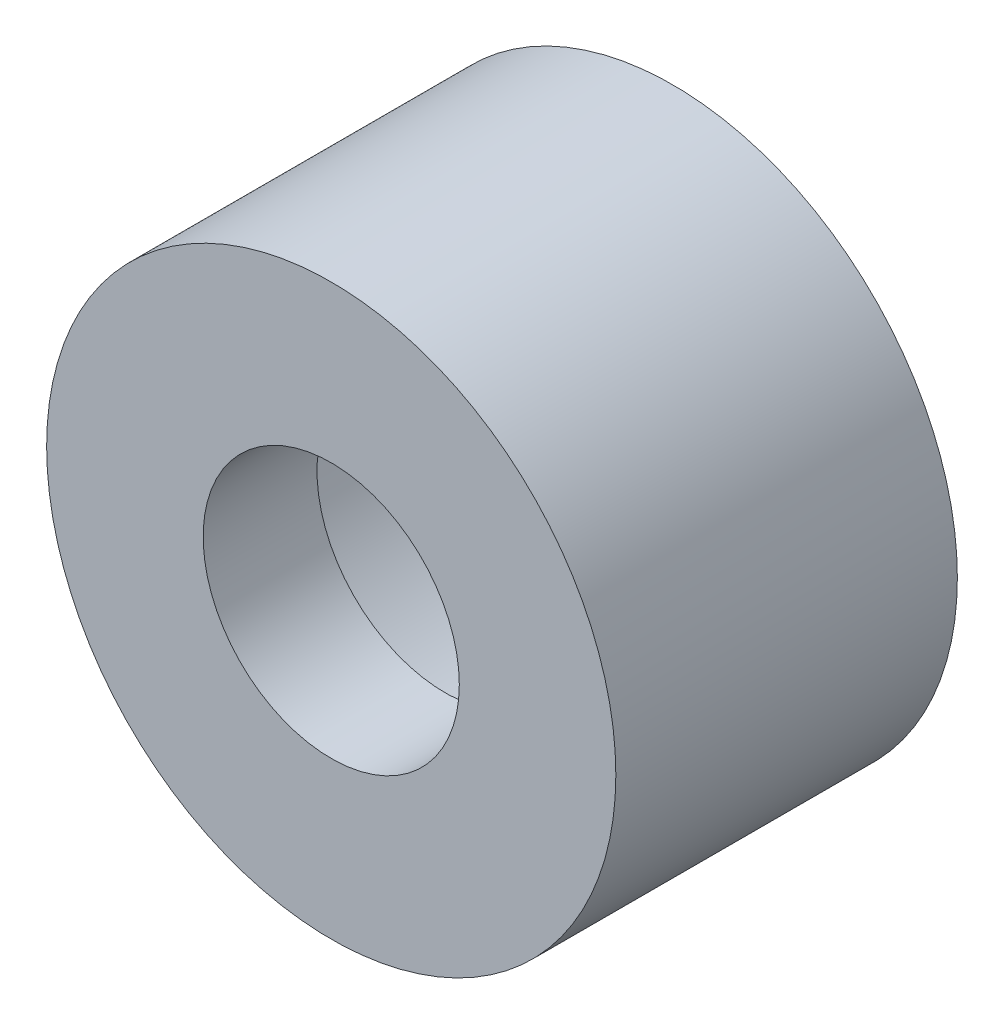
ISO-10303-21;
HEADER;
FILE_DESCRIPTION(('STEP AP214'),'2;1');
FILE_NAME('part.step','',(''),(''),'','','');
FILE_SCHEMA(('AUTOMOTIVE_DESIGN { 1 0 10303 214 1 1 1 1 }'));
ENDSEC;
DATA;
#1=APPLICATION_CONTEXT('core data for automotive mechanical design processes');
#2=APPLICATION_PROTOCOL_DEFINITION('international standard','automotive_design',2000,#1);
#3=PRODUCT_CONTEXT('',#1,'mechanical');
#4=PRODUCT('Part','Part','',(#3));
#5=PRODUCT_RELATED_PRODUCT_CATEGORY('part','',(#4));
#6=PRODUCT_DEFINITION_FORMATION('','',#4);
#7=PRODUCT_DEFINITION_CONTEXT('part definition',#1,'design');
#8=PRODUCT_DEFINITION('design','',#6,#7);
#9=PRODUCT_DEFINITION_SHAPE('','',#8);
#10=(LENGTH_UNIT() NAMED_UNIT(*) SI_UNIT(.MILLI.,.METRE.));
#11=(NAMED_UNIT(*) PLANE_ANGLE_UNIT() SI_UNIT($,.RADIAN.));
#12=(NAMED_UNIT(*) SI_UNIT($,.STERADIAN.) SOLID_ANGLE_UNIT());
#13=UNCERTAINTY_MEASURE_WITH_UNIT(LENGTH_MEASURE(1.E-05),#10,'distance_accuracy_value','');
#14=(GEOMETRIC_REPRESENTATION_CONTEXT(3) GLOBAL_UNCERTAINTY_ASSIGNED_CONTEXT((#13)) GLOBAL_UNIT_ASSIGNED_CONTEXT((#10,
#11,#12)) REPRESENTATION_CONTEXT('',''));
#15=CARTESIAN_POINT('',(0.,0.,0.));
#16=DIRECTION('',(0.,0.,1.));
#17=DIRECTION('',(1.,0.,0.));
#18=AXIS2_PLACEMENT_3D('',#15,#16,#17);
#19=CARTESIAN_POINT('',(0.,0.,0.));
#20=DIRECTION('',(0.,0.,1.));
#21=DIRECTION('',(1.,0.,0.));
#22=AXIS2_PLACEMENT_3D('',#19,#20,#21);
#23=PLANE('',#22);
#24=CARTESIAN_POINT('',(0.,0.,0.));
#25=DIRECTION('',(0.,0.,1.));
#26=DIRECTION('',(1.,0.,0.));
#27=AXIS2_PLACEMENT_3D('',#24,#25,#26);
#28=CIRCLE('',#27,5.);
#29=CARTESIAN_POINT('',(5.,0.,0.));
#30=VERTEX_POINT('',#29);
#31=EDGE_CURVE('E10',#30,#30,#28,.T.);
#32=ORIENTED_EDGE('',*,*,#31,.F.);
#33=EDGE_LOOP('',(#32));
#34=FACE_BOUND('',#33,.T.);
#35=CARTESIAN_POINT('',(0.,0.,0.));
#36=DIRECTION('',(0.,0.,1.));
#37=DIRECTION('',(1.,0.,0.));
#38=AXIS2_PLACEMENT_3D('',#35,#36,#37);
#39=CIRCLE('',#38,4.25);
#40=CARTESIAN_POINT('',(4.25,0.,0.));
#41=VERTEX_POINT('',#40);
#42=EDGE_CURVE('E41',#41,#41,#39,.T.);
#43=ORIENTED_EDGE('',*,*,#42,.T.);
#44=EDGE_LOOP('',(#43));
#45=FACE_BOUND('',#44,.T.);
#46=ADVANCED_FACE('F34',(#34,#45),#23,.F.);
#47=CARTESIAN_POINT('',(0.,0.,4.));
#48=DIRECTION('',(0.,0.,-1.));
#49=DIRECTION('',(-1.,0.,0.));
#50=AXIS2_PLACEMENT_3D('',#47,#48,#49);
#51=CYLINDRICAL_SURFACE('',#50,5.);
#52=ORIENTED_EDGE('',*,*,#31,.T.);
#53=EDGE_LOOP('',(#52));
#54=FACE_BOUND('',#53,.T.);
#55=CARTESIAN_POINT('',(0.,0.,6.));
#56=DIRECTION('',(0.,0.,1.));
#57=DIRECTION('',(1.,0.,0.));
#58=AXIS2_PLACEMENT_3D('',#55,#56,#57);
#59=CIRCLE('',#58,5.);
#60=CARTESIAN_POINT('',(5.,0.,6.));
#61=VERTEX_POINT('',#60);
#62=EDGE_CURVE('E49',#61,#61,#59,.T.);
#63=ORIENTED_EDGE('',*,*,#62,.F.);
#64=EDGE_LOOP('',(#63));
#65=FACE_BOUND('',#64,.T.);
#66=ADVANCED_FACE('F36',(#54,#65),#51,.T.);
#67=CARTESIAN_POINT('',(0.,0.,4.));
#68=DIRECTION('',(0.,0.,-1.));
#69=DIRECTION('',(-1.,0.,0.));
#70=AXIS2_PLACEMENT_3D('',#67,#68,#69);
#71=CYLINDRICAL_SURFACE('',#70,4.25);
#72=CARTESIAN_POINT('',(0.,0.,4.));
#73=DIRECTION('',(0.,0.,1.));
#74=DIRECTION('',(1.,0.,0.));
#75=AXIS2_PLACEMENT_3D('',#72,#73,#74);
#76=CIRCLE('',#75,4.25);
#77=CARTESIAN_POINT('',(4.25,0.,4.));
#78=VERTEX_POINT('',#77);
#79=EDGE_CURVE('E45',#78,#78,#76,.T.);
#80=ORIENTED_EDGE('',*,*,#79,.T.);
#81=EDGE_LOOP('',(#80));
#82=FACE_BOUND('',#81,.T.);
#83=ORIENTED_EDGE('',*,*,#42,.F.);
#84=EDGE_LOOP('',(#83));
#85=FACE_BOUND('',#84,.T.);
#86=ADVANCED_FACE('F74',(#82,#85),#71,.F.);
#87=CARTESIAN_POINT('',(0.,0.,4.));
#88=DIRECTION('',(0.,0.,1.));
#89=DIRECTION('',(1.,0.,0.));
#90=AXIS2_PLACEMENT_3D('',#87,#88,#89);
#91=PLANE('',#90);
#92=CARTESIAN_POINT('',(0.,0.,4.));
#93=DIRECTION('',(0.,0.,1.));
#94=DIRECTION('',(1.,0.,0.));
#95=AXIS2_PLACEMENT_3D('',#92,#93,#94);
#96=CIRCLE('',#95,2.25);
#97=CARTESIAN_POINT('',(2.25,0.,4.));
#98=VERTEX_POINT('',#97);
#99=EDGE_CURVE('E55',#98,#98,#96,.T.);
#100=ORIENTED_EDGE('',*,*,#99,.T.);
#101=EDGE_LOOP('',(#100));
#102=FACE_BOUND('',#101,.T.);
#103=ORIENTED_EDGE('',*,*,#79,.F.);
#104=EDGE_LOOP('',(#103));
#105=FACE_BOUND('',#104,.T.);
#106=ADVANCED_FACE('F66',(#102,#105),#91,.F.);
#107=CARTESIAN_POINT('',(0.,0.,6.));
#108=DIRECTION('',(0.,0.,1.));
#109=DIRECTION('',(1.,0.,0.));
#110=AXIS2_PLACEMENT_3D('',#107,#108,#109);
#111=PLANE('',#110);
#112=ORIENTED_EDGE('',*,*,#62,.T.);
#113=EDGE_LOOP('',(#112));
#114=FACE_BOUND('',#113,.T.);
#115=CARTESIAN_POINT('',(0.,0.,6.));
#116=DIRECTION('',(0.,0.,1.));
#117=DIRECTION('',(1.,0.,0.));
#118=AXIS2_PLACEMENT_3D('',#115,#116,#117);
#119=CIRCLE('',#118,2.25);
#120=CARTESIAN_POINT('',(2.25,0.,6.));
#121=VERTEX_POINT('',#120);
#122=EDGE_CURVE('E54',#121,#121,#119,.T.);
#123=ORIENTED_EDGE('',*,*,#122,.F.);
#124=EDGE_LOOP('',(#123));
#125=FACE_BOUND('',#124,.T.);
#126=ADVANCED_FACE('F64',(#114,#125),#111,.T.);
#127=CARTESIAN_POINT('',(0.,0.,6.));
#128=DIRECTION('',(0.,0.,-1.));
#129=DIRECTION('',(-1.,0.,0.));
#130=AXIS2_PLACEMENT_3D('',#127,#128,#129);
#131=CYLINDRICAL_SURFACE('',#130,2.25);
#132=ORIENTED_EDGE('',*,*,#122,.T.);
#133=EDGE_LOOP('',(#132));
#134=FACE_BOUND('',#133,.T.);
#135=ORIENTED_EDGE('',*,*,#99,.F.);
#136=EDGE_LOOP('',(#135));
#137=FACE_BOUND('',#136,.T.);
#138=ADVANCED_FACE('F61',(#134,#137),#131,.F.);
#139=CLOSED_SHELL('',(#46,#66,#86,#106,#126,#138));
#140=MANIFOLD_SOLID_BREP('B2',#139);
#141=ADVANCED_BREP_SHAPE_REPRESENTATION('',(#18,#140),#14);
#142=SHAPE_DEFINITION_REPRESENTATION(#9,#141);
ENDSEC;
END-ISO-10303-21;
